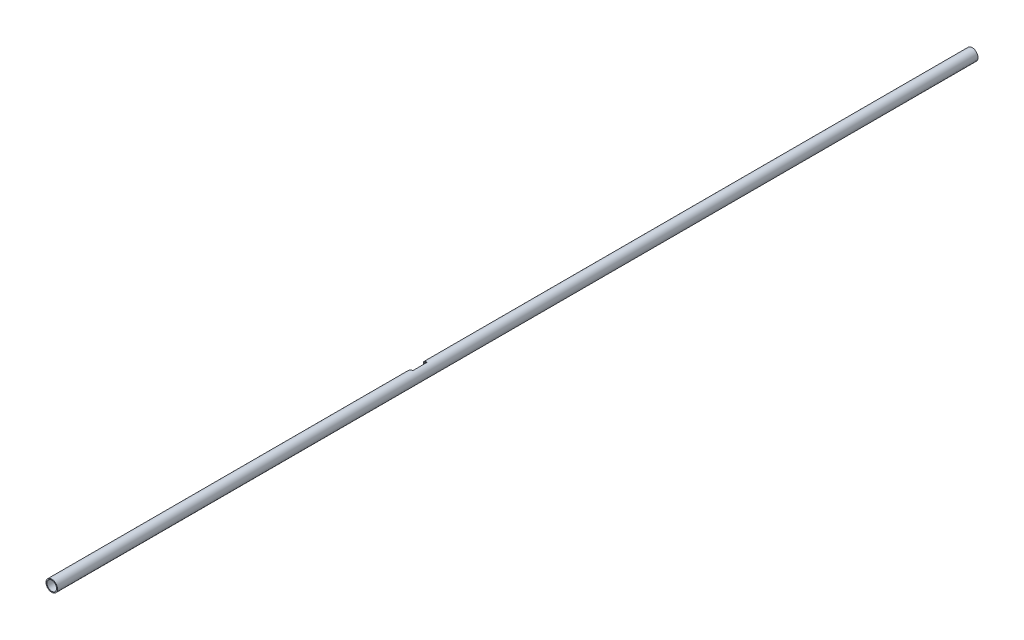
ISO-10303-21;
HEADER;
FILE_DESCRIPTION(('STEP AP214'),'2;1');
FILE_NAME('part.step','',(''),(''),'','','');
FILE_SCHEMA(('AUTOMOTIVE_DESIGN { 1 0 10303 214 1 1 1 1 }'));
ENDSEC;
DATA;
#1=APPLICATION_CONTEXT('core data for automotive mechanical design processes');
#2=APPLICATION_PROTOCOL_DEFINITION('international standard','automotive_design',2000,#1);
#3=PRODUCT_CONTEXT('',#1,'mechanical');
#4=PRODUCT('Part','Part','',(#3));
#5=PRODUCT_RELATED_PRODUCT_CATEGORY('part','',(#4));
#6=PRODUCT_DEFINITION_FORMATION('','',#4);
#7=PRODUCT_DEFINITION_CONTEXT('part definition',#1,'design');
#8=PRODUCT_DEFINITION('design','',#6,#7);
#9=PRODUCT_DEFINITION_SHAPE('','',#8);
#10=(LENGTH_UNIT() NAMED_UNIT(*) SI_UNIT(.MILLI.,.METRE.));
#11=(NAMED_UNIT(*) PLANE_ANGLE_UNIT() SI_UNIT($,.RADIAN.));
#12=(NAMED_UNIT(*) SI_UNIT($,.STERADIAN.) SOLID_ANGLE_UNIT());
#13=UNCERTAINTY_MEASURE_WITH_UNIT(LENGTH_MEASURE(1.E-05),#10,'distance_accuracy_value','');
#14=(GEOMETRIC_REPRESENTATION_CONTEXT(3) GLOBAL_UNCERTAINTY_ASSIGNED_CONTEXT((#13)) GLOBAL_UNIT_ASSIGNED_CONTEXT((#10,
#11,#12)) REPRESENTATION_CONTEXT('',''));
#15=CARTESIAN_POINT('',(0.,0.,0.));
#16=DIRECTION('',(0.,0.,1.));
#17=DIRECTION('',(1.,0.,0.));
#18=AXIS2_PLACEMENT_3D('',#15,#16,#17);
#19=CARTESIAN_POINT('',(0.,0.,3048.));
#20=DIRECTION('',(0.,0.,1.));
#21=DIRECTION('',(1.,0.,0.));
#22=AXIS2_PLACEMENT_3D('',#19,#20,#21);
#23=PLANE('',#22);
#24=CARTESIAN_POINT('',(0.,0.,3048.));
#25=DIRECTION('',(0.,0.,1.));
#26=DIRECTION('',(1.,0.,0.));
#27=AXIS2_PLACEMENT_3D('',#24,#25,#26);
#28=CIRCLE('',#27,19.05);
#29=CARTESIAN_POINT('',(19.05,0.,3048.));
#30=VERTEX_POINT('',#29);
#31=EDGE_CURVE('E142',#30,#30,#28,.T.);
#32=ORIENTED_EDGE('',*,*,#31,.T.);
#33=EDGE_LOOP('',(#32));
#34=FACE_BOUND('',#33,.T.);
#35=CARTESIAN_POINT('',(0.,0.,3048.));
#36=DIRECTION('',(0.,0.,1.));
#37=DIRECTION('',(1.,0.,0.));
#38=AXIS2_PLACEMENT_3D('',#35,#36,#37);
#39=CIRCLE('',#38,15.875);
#40=CARTESIAN_POINT('',(15.875,0.,3048.));
#41=VERTEX_POINT('',#40);
#42=EDGE_CURVE('E136',#41,#41,#39,.T.);
#43=ORIENTED_EDGE('',*,*,#42,.F.);
#44=EDGE_LOOP('',(#43));
#45=FACE_BOUND('',#44,.T.);
#46=ADVANCED_FACE('F32',(#34,#45),#23,.T.);
#47=CARTESIAN_POINT('',(0.,0.,0.));
#48=DIRECTION('',(0.,0.,1.));
#49=DIRECTION('',(1.,0.,0.));
#50=AXIS2_PLACEMENT_3D('',#47,#48,#49);
#51=PLANE('',#50);
#52=CARTESIAN_POINT('',(0.,0.,0.));
#53=DIRECTION('',(0.,0.,1.));
#54=DIRECTION('',(1.,0.,0.));
#55=AXIS2_PLACEMENT_3D('',#52,#53,#54);
#56=CIRCLE('',#55,19.05);
#57=CARTESIAN_POINT('',(19.05,0.,0.));
#58=VERTEX_POINT('',#57);
#59=EDGE_CURVE('E139',#58,#58,#56,.T.);
#60=ORIENTED_EDGE('',*,*,#59,.F.);
#61=EDGE_LOOP('',(#60));
#62=FACE_BOUND('',#61,.T.);
#63=CARTESIAN_POINT('',(0.,0.,0.));
#64=DIRECTION('',(0.,0.,1.));
#65=DIRECTION('',(1.,0.,0.));
#66=AXIS2_PLACEMENT_3D('',#63,#64,#65);
#67=CIRCLE('',#66,15.875);
#68=CARTESIAN_POINT('',(15.875,0.,0.));
#69=VERTEX_POINT('',#68);
#70=EDGE_CURVE('E81',#69,#69,#67,.T.);
#71=ORIENTED_EDGE('',*,*,#70,.T.);
#72=EDGE_LOOP('',(#71));
#73=FACE_BOUND('',#72,.T.);
#74=ADVANCED_FACE('F149',(#62,#73),#51,.F.);
#75=CARTESIAN_POINT('',(0.,0.,3048.));
#76=DIRECTION('',(0.,0.,-1.));
#77=DIRECTION('',(-1.,0.,0.));
#78=AXIS2_PLACEMENT_3D('',#75,#76,#77);
#79=CYLINDRICAL_SURFACE('',#78,19.05);
#80=CARTESIAN_POINT('',(0.,19.05,1852.2671808277));
#81=CARTESIAN_POINT('',(-0.237913261552486,19.0500075669226,1852.26716589824));
#82=CARTESIAN_POINT('',(-0.475820359440934,19.0455432689942,1852.27079845793));
#83=CARTESIAN_POINT('',(-0.951064162118166,19.0277282029307,1852.2852480478));
#84=CARTESIAN_POINT('',(-1.18840091207045,19.014378163365,1852.29606448895));
#85=CARTESIAN_POINT('',(-1.66172427825179,18.9788684265299,1852.32475555512));
#86=CARTESIAN_POINT('',(-1.89771209381287,18.9567184505884,1852.3426223914));
#87=CARTESIAN_POINT('',(-2.36807231072878,18.9037237472348,1852.38519551471));
#88=CARTESIAN_POINT('',(-2.60244469016893,18.8728789021068,1852.40990189435));
#89=CARTESIAN_POINT('',(-3.29829215747621,18.7681203736737,1852.49339141651));
#90=CARTESIAN_POINT('',(-3.75681202461572,18.6816544503487,1852.56181551437));
#91=CARTESIAN_POINT('',(-4.66244518831297,18.4764685925903,1852.721705705));
#92=CARTESIAN_POINT('',(-5.10955575066431,18.3577410046947,1852.81317726496));
#93=CARTESIAN_POINT('',(-5.98795765621618,18.0902383667251,1853.01533198587));
#94=CARTESIAN_POINT('',(-6.41930948505075,17.9415966150532,1853.12592962318));
#95=CARTESIAN_POINT('',(-7.26639917201875,17.615559887581,1853.36305610455));
#96=CARTESIAN_POINT('',(-7.6821376293133,17.438166016531,1853.48958433646));
#97=CARTESIAN_POINT('',(-8.49768945260892,17.0556478749041,1853.75536613615));
#98=CARTESIAN_POINT('',(-8.89746295560427,16.8504592022841,1853.8946490068));
#99=CARTESIAN_POINT('',(-9.67909367745971,16.4139593807486,1854.18230375715));
#100=CARTESIAN_POINT('',(-10.060948704398,16.1826450476773,1854.33067674373));
#101=CARTESIAN_POINT('',(-10.8564159962534,15.6619384534184,1854.6538375673));
#102=CARTESIAN_POINT('',(-11.2673139394046,15.3689240395668,1854.82947920576));
#103=CARTESIAN_POINT('',(-12.0637546860205,14.75201945163,1855.18400252564));
#104=CARTESIAN_POINT('',(-12.4492959211275,14.428127370735,1855.3628844066));
#105=CARTESIAN_POINT('',(-13.1938891566226,13.7505358175611,1855.71989081054));
#106=CARTESIAN_POINT('',(-13.552932285477,13.3968264466337,1855.89801506122));
#107=CARTESIAN_POINT('',(-14.2429269408907,12.6608060219891,1856.24961636432));
#108=CARTESIAN_POINT('',(-14.5738768292642,12.2784933027828,1856.42309314533));
#109=CARTESIAN_POINT('',(-15.2451465976967,11.4373194464688,1856.78272814046));
#110=CARTESIAN_POINT('',(-15.5815436809978,10.974843739489,1856.9677931465));
#111=CARTESIAN_POINT('',(-16.2137879973683,10.0172234159492,1857.32239489818));
#112=CARTESIAN_POINT('',(-16.5096310129868,9.52207540952876,1857.49193002817));
#113=CARTESIAN_POINT('',(-17.0572867999425,8.50213133744733,1857.81051598198));
#114=CARTESIAN_POINT('',(-17.3091299143676,7.97735603635815,1857.9595809071));
#115=CARTESIAN_POINT('',(-17.7655359307114,6.90141460910731,1858.2327947757));
#116=CARTESIAN_POINT('',(-17.9701076176427,6.35025340957205,1858.3569483482));
#117=CARTESIAN_POINT('',(-18.3101545422171,5.28401739618659,1858.56498270943));
#118=CARTESIAN_POINT('',(-18.4505756134686,4.77107065705129,1858.65169401363));
#119=CARTESIAN_POINT('',(-18.6885349327689,3.73166230635024,1858.799353063));
#120=CARTESIAN_POINT('',(-18.7860758531181,3.20520153914652,1858.86030241365));
#121=CARTESIAN_POINT('',(-18.9365485673955,2.14396727874143,1858.95456864965));
#122=CARTESIAN_POINT('',(-18.9895202776267,1.6092016615669,1858.98791026014));
#123=CARTESIAN_POINT('',(-19.0500331020588,0.536113862418739,1859.0260113584));
#124=CARTESIAN_POINT('',(-19.0575795821051,-0.00220789196607137,1859.03077422202));
#125=CARTESIAN_POINT('',(-19.0292136788875,-1.00354059727567,1859.0129029026));
#126=CARTESIAN_POINT('',(-18.9990963706189,-1.46679518249212,1858.99392191017));
#127=CARTESIAN_POINT('',(-18.9053442990758,-2.38850993247263,1858.93501746791));
#128=CARTESIAN_POINT('',(-18.8417133700412,-2.84697063957854,1858.89509641381));
#129=CARTESIAN_POINT('',(-18.6817684312544,-3.75593126314168,1858.79521886666));
#130=CARTESIAN_POINT('',(-18.5854530110353,-4.20643083516116,1858.73526150898));
#131=CARTESIAN_POINT('',(-18.361320835631,-5.09657418070307,1858.59662613637));
#132=CARTESIAN_POINT('',(-18.2335027480993,-5.53621749421487,1858.51794732966));
#133=CARTESIAN_POINT('',(-17.9475472680348,-6.40286205310939,1858.34336116287));
#134=CARTESIAN_POINT('',(-17.7893574589542,-6.82983994748656,1858.24742403611));
#135=CARTESIAN_POINT('',(-17.4443800430196,-7.66821997933194,1858.04031371512));
#136=CARTESIAN_POINT('',(-17.2575928036684,-8.07962231687542,1857.92914071669));
#137=CARTESIAN_POINT('',(-16.8570265577348,-8.88512777933834,1857.69362686788));
#138=CARTESIAN_POINT('',(-16.6432471955372,-9.27923067624941,1857.56928584402));
#139=CARTESIAN_POINT('',(-16.1902483308365,-10.0487690011342,1857.30961718739));
#140=CARTESIAN_POINT('',(-15.9510260158205,-10.4242023585953,1857.17428834039));
#141=CARTESIAN_POINT('',(-15.4171388478185,-11.2010448659687,1856.87742005095));
#142=CARTESIAN_POINT('',(-15.1192825145513,-11.5998196349006,1856.71472050958));
#143=CARTESIAN_POINT('',(-14.4950846033296,-12.3709805231003,1856.38163111637));
#144=CARTESIAN_POINT('',(-14.1687410187786,-12.7433647801098,1856.21124072321));
#145=CARTESIAN_POINT('',(-13.4885883068924,-13.4612557153978,1855.86593035904));
#146=CARTESIAN_POINT('',(-13.1347321854433,-13.8067142936616,1855.69100299372));
#147=CARTESIAN_POINT('',(-12.401421579444,-14.4689793476887,1855.34053687841));
#148=CARTESIAN_POINT('',(-12.0219656723807,-14.7857842289477,1855.16499809497));
#149=CARTESIAN_POINT('',(-11.1857883621707,-15.4303472136638,1854.79368693179));
#150=CARTESIAN_POINT('',(-10.725547194885,-15.7538236022507,1854.5983773441));
#151=CARTESIAN_POINT('',(-9.77512493835074,-16.3605414403376,1854.21794683031));
#152=CARTESIAN_POINT('',(-9.28493893539641,-16.6437762610244,1854.03282758588));
#153=CARTESIAN_POINT('',(-8.27823061346436,-17.1666523017985,1853.68003728454));
#154=CARTESIAN_POINT('',(-7.76180901246432,-17.4064461679541,1853.51230605383));
#155=CARTESIAN_POINT('',(-6.70338967441411,-17.8407952434688,1853.20058712969));
#156=CARTESIAN_POINT('',(-6.16139968402448,-18.035364050473,1853.05659230333));
#157=CARTESIAN_POINT('',(-5.1639713786844,-18.3426351560322,1852.82474192916));
#158=CARTESIAN_POINT('',(-4.71243156933752,-18.4639105575953,1852.7314149047));
#159=CARTESIAN_POINT('',(-3.79763406932198,-18.6735204660137,1852.56822367759));
#160=CARTESIAN_POINT('',(-3.33438106935586,-18.7618679429894,1852.49835023779));
#161=CARTESIAN_POINT('',(-2.63119041126603,-18.8689253625022,1852.4130634991));
#162=CARTESIAN_POINT('',(-2.39429949153897,-18.900452532875,1852.38781813152));
#163=CARTESIAN_POINT('',(-1.91884922194373,-18.9546230604504,1852.34431056888));
#164=CARTESIAN_POINT('',(-1.68028989962893,-18.9772665640143,1852.32604825877));
#165=CARTESIAN_POINT('',(-1.20173979669572,-19.0135731857589,1852.29671643215));
#166=CARTESIAN_POINT('',(-0.96174756682334,-19.0272246853348,1852.28565622171));
#167=CARTESIAN_POINT('',(-0.481172431453062,-19.0454424381129,1852.27088030018));
#168=CARTESIAN_POINT('',(-0.240589475851749,-19.0500078919985,1852.26716523527));
#169=CARTESIAN_POINT('',(0.,-19.05,1852.2671808277));
#170=B_SPLINE_CURVE_WITH_KNOTS('',3,(#80,#81,#82,#83,#84,#85,#86,#87,#88,#89,#90,#91,#92,#93,
#94,#95,#96,#97,#98,#99,#100,#101,#102,#103,#104,#105,#106,#107,#108,#109,#110,#111,#112,#113,
#114,#115,#116,#117,#118,#119,#120,#121,#122,#123,#124,#125,#126,#127,#128,#129,#130,#131,#132,
#133,#134,#135,#136,#137,#138,#139,#140,#141,#142,#143,#144,#145,#146,#147,#148,#149,#150,#151,
#152,#153,#154,#155,#156,#157,#158,#159,#160,#161,#162,#163,#164,#165,#166,#167,#168,#169),
.UNSPECIFIED.,.F.,.F.,(4,2,2,2,2,2,2,2,2,2,2,2,2,2,2,2,2,2,2,2,2,2,2,2,2,2,2,2,2,2,2,2,2,2,2,2,
2,2,2,2,2,2,2,2,4),(0.,0.713659538284325,1.42726056863278,2.14007546311611,2.85290000854321,
4.2655934325813,5.67862228410906,7.08548876133536,8.49230119496029,9.90243089753133,
11.3127326504009,12.9142575198248,14.5158813534507,16.118038998867,17.7202900059383,
19.5211317505805,21.3221606332672,23.1219425504799,24.9213897232974,26.5355472079785,
28.1496040837428,29.7622138624865,31.3746331483099,32.7668190077326,34.1588456239806,
35.5509323194048,36.943077900644,38.3376480491618,39.7322002776946,41.1267708810513,
42.5214958034614,44.090873437741,45.6603617058085,47.2325923357602,48.8049104025291,
50.5892093576005,52.3738018923156,54.1519965250575,55.9296558212526,57.358308144593,
58.7863971337687,59.5071013173353,60.2277936265736,60.9494153280388,61.671100509134),.UNSPECIFIED.);
#171=CARTESIAN_POINT('',(0.,19.05,1852.2671808277));
#172=VERTEX_POINT('',#171);
#173=CARTESIAN_POINT('',(0.,-19.05,1852.2671808277));
#174=VERTEX_POINT('',#173);
#175=EDGE_CURVE('E82',#172,#174,#170,.T.);
#176=ORIENTED_EDGE('',*,*,#175,.T.);
#177=DIRECTION('',(0.,0.,-1.));
#178=VECTOR('',#177,1.);
#179=CARTESIAN_POINT('',(0.,-19.05,3048.));
#180=LINE('',#179,#178);
#181=CARTESIAN_POINT('',(0.,-19.05,1805.3328191723));
#182=VERTEX_POINT('',#181);
#183=EDGE_CURVE('E77',#174,#182,#180,.T.);
#184=ORIENTED_EDGE('',*,*,#183,.T.);
#185=CARTESIAN_POINT('',(0.,-19.05,1805.3328191723));
#186=CARTESIAN_POINT('',(-0.237914153691984,-19.0500075670417,1805.33283410199));
#187=CARTESIAN_POINT('',(-0.475822143650489,-19.0455432355743,1805.32920151495));
#188=CARTESIAN_POINT('',(-0.95106772435545,-19.0277280359797,1805.31475181686));
#189=CARTESIAN_POINT('',(-1.1884053602656,-19.0143778964222,1805.30393529485));
#190=CARTESIAN_POINT('',(-1.66173048176436,-18.978867894416,1805.27524401544));
#191=CARTESIAN_POINT('',(-1.89771916671416,-18.9567177534948,1805.25737704694));
#192=CARTESIAN_POINT('',(-2.36808110452714,-18.9037226566038,1805.21480361077));
#193=CARTESIAN_POINT('',(-2.60245433547799,-18.8728775829311,1805.1900970505));
#194=CARTESIAN_POINT('',(-3.29830083882364,-18.7681188036051,1805.10660733991));
#195=CARTESIAN_POINT('',(-3.75681891684868,-18.6816530205333,1805.0381833634));
#196=CARTESIAN_POINT('',(-4.66244857237881,-18.4764676940087,1804.87829360278));
#197=CARTESIAN_POINT('',(-5.10955741586316,-18.3577404976212,1804.78682235186));
#198=CARTESIAN_POINT('',(-5.98795842654919,-18.0902381320981,1804.58466783679));
#199=CARTESIAN_POINT('',(-6.41931100257116,-17.9415960921057,1804.47406998768));
#200=CARTESIAN_POINT('',(-7.26640215150174,-17.6155586796621,1804.23694302572));
#201=CARTESIAN_POINT('',(-7.68214132262911,-17.4381644102235,1804.11041452406));
#202=CARTESIAN_POINT('',(-8.49769303876842,-17.0556460666155,1803.84463263084));
#203=CARTESIAN_POINT('',(-8.8974657816884,-16.8504576888484,1803.70534998122));
#204=CARTESIAN_POINT('',(-9.67909504442834,-16.4139585525683,1803.41769571169));
#205=CARTESIAN_POINT('',(-10.0609493724786,-16.1826446101205,1803.26932298498));
#206=CARTESIAN_POINT('',(-10.8564054855232,-15.6619453339278,1802.94616670258));
#207=CARTESIAN_POINT('',(-11.2672935150549,-15.3689386049129,1802.77052952407));
#208=CARTESIAN_POINT('',(-12.063716151625,-14.7520505544343,1802.41601498909));
#209=CARTESIAN_POINT('',(-12.4492491630937,-14.4281672930723,1802.23713742962));
#210=CARTESIAN_POINT('',(-13.1938460385474,-13.7505776842584,1801.88013044577));
#211=CARTESIAN_POINT('',(-13.5528996907022,-13.3968599426342,1801.70200133475));
#212=CARTESIAN_POINT('',(-14.2429123643773,-12.6608228438368,1801.3503912768));
#213=CARTESIAN_POINT('',(-14.5738698758174,-12.2785019514082,1801.17691058005));
#214=CARTESIAN_POINT('',(-15.2452066237803,-11.4372443001128,1800.81723970031));
#215=CARTESIAN_POINT('',(-15.5816573531608,-10.9746877470026,1800.63214431774));
#216=CARTESIAN_POINT('',(-16.2140015900617,-10.016883712999,1800.27748408674));
#217=CARTESIAN_POINT('',(-16.5098900402814,-9.52163216708129,1800.10792117577));
#218=CARTESIAN_POINT('',(-17.0575283268076,-8.50164235748947,1799.78934162943));
#219=CARTESIAN_POINT('',(-17.3093227932902,-7.97693462712917,1799.64030425195));
#220=CARTESIAN_POINT('',(-17.7656282909535,-6.90116359008016,1799.36714931439));
#221=CARTESIAN_POINT('',(-17.9701521709603,-6.3501074945223,1799.24302498379));
#222=CARTESIAN_POINT('',(-18.2967017300188,-5.32620454622214,1799.0432469858));
#223=CARTESIAN_POINT('',(-18.4269301606666,-4.85687437293046,1798.96289908963));
#224=CARTESIAN_POINT('',(-18.6515222856821,-3.90659321756069,1798.82367482707));
#225=CARTESIAN_POINT('',(-18.7458905947937,-3.42564373921809,1798.76479569795));
#226=CARTESIAN_POINT('',(-18.8973893204789,-2.45597826270617,1798.67000815948));
#227=CARTESIAN_POINT('',(-18.9545431323425,-1.9672673422146,1798.63408531866));
#228=CARTESIAN_POINT('',(-19.0308483949891,-0.985702436673155,1798.58608134698));
#229=CARTESIAN_POINT('',(-19.0499995417971,-0.492848418515196,1798.57400040681));
#230=CARTESIAN_POINT('',(-19.0500004498985,0.483916056463942,1798.57399960056));
#231=CARTESIAN_POINT('',(-19.0315380930153,0.967826714421099,1798.58564580861));
#232=CARTESIAN_POINT('',(-18.9579680200735,1.93172933497667,1798.63193225655));
#233=CARTESIAN_POINT('',(-18.9028608707327,2.41172135806121,1798.66657214085));
#234=CARTESIAN_POINT('',(-18.7567811892408,3.36420800661081,1798.75799313547));
#235=CARTESIAN_POINT('',(-18.6657974678684,3.83670024516548,1798.81478115333));
#236=CARTESIAN_POINT('',(-18.4492081253785,4.77064312049217,1798.94912652618));
#237=CARTESIAN_POINT('',(-18.3236019404525,5.23209357732163,1799.0266842194));
#238=CARTESIAN_POINT('',(-18.0399652699786,6.13896547312149,1799.20039835224));
#239=CARTESIAN_POINT('',(-17.8820808393242,6.58444884700174,1799.29647090598));
#240=CARTESIAN_POINT('',(-17.5352833397821,7.45906619035572,1799.50536594758));
#241=CARTESIAN_POINT('',(-17.3463704656401,7.88820026242271,1799.61818833032));
#242=CARTESIAN_POINT('',(-16.939320017612,8.72809980980323,1799.85829770114));
#243=CARTESIAN_POINT('',(-16.7211839946016,9.13886625834661,1799.98558392156));
#244=CARTESIAN_POINT('',(-16.2574144369317,9.94049551036888,1800.25221372785));
#245=CARTESIAN_POINT('',(-16.0117778739574,10.3313561149401,1800.39155864123));
#246=CARTESIAN_POINT('',(-15.4739177901683,11.1223691722249,1800.69133743608));
#247=CARTESIAN_POINT('',(-15.1795381102433,11.5207540673358,1800.85256641061));
#248=CARTESIAN_POINT('',(-14.5624763475896,12.2914817788361,1801.18286099129));
#249=CARTESIAN_POINT('',(-14.2397930853102,12.663823508714,1801.35192692389));
#250=CARTESIAN_POINT('',(-13.5671836246638,13.3819448018547,1801.69477567355));
#251=CARTESIAN_POINT('',(-13.2172142598011,13.727680484639,1801.86856566912));
#252=CARTESIAN_POINT('',(-12.4918477463068,14.3908922168729,1802.21704212433));
#253=CARTESIAN_POINT('',(-12.1164489336129,14.7083664137842,1802.39172864194));
#254=CARTESIAN_POINT('',(-11.2873636395029,15.3561684071717,1802.7623906972));
#255=CARTESIAN_POINT('',(-10.8300569007558,15.6821240080865,1802.95794126779));
#256=CARTESIAN_POINT('',(-9.88547176007127,16.2940682653242,1803.33935479063));
#257=CARTESIAN_POINT('',(-9.39818864184241,16.5800506092315,1803.5252162099));
#258=CARTESIAN_POINT('',(-8.39715816889244,17.1087551853641,1803.88007620821));
#259=CARTESIAN_POINT('',(-7.88350908314443,17.3516248756513,1804.049131361));
#260=CARTESIAN_POINT('',(-6.83047578714224,17.7924877091458,1804.36412596754));
#261=CARTESIAN_POINT('',(-6.29109841589317,17.990492698549,1804.51007152014));
#262=CARTESIAN_POINT('',(-5.28671126493464,18.307917238977,1804.74873281407));
#263=CARTESIAN_POINT('',(-4.8252753749099,18.4350309119997,1804.84629544277));
#264=CARTESIAN_POINT('',(-3.88987463160733,18.6548081357988,1805.01705047138));
#265=CARTESIAN_POINT('',(-3.41591492446545,18.747485607959,1805.09025271811));
#266=CARTESIAN_POINT('',(-2.69607464054149,18.8598388532735,1805.17967403736));
#267=CARTESIAN_POINT('',(-2.45346219807751,18.8929394219366,1805.20616113088));
#268=CARTESIAN_POINT('',(-1.96644459477794,18.9498197790469,1805.25182066811));
#269=CARTESIAN_POINT('',(-1.72203946560219,18.9735997316994,1805.27099324068));
#270=CARTESIAN_POINT('',(-1.2316829556265,19.0117332790076,1805.30179357217));
#271=CARTESIAN_POINT('',(-0.985729907213888,19.0260738283793,1805.31341088943));
#272=CARTESIAN_POINT('',(-0.493187017172825,19.0452120016008,1805.32893266052));
#273=CARTESIAN_POINT('',(-0.246597116526002,19.0500087067213,1805.33283637181));
#274=CARTESIAN_POINT('',(0.,19.05,1805.3328191723));
#275=B_SPLINE_CURVE_WITH_KNOTS('',3,(#185,#186,#187,#188,#189,#190,#191,#192,#193,#194,#195,
#196,#197,#198,#199,#200,#201,#202,#203,#204,#205,#206,#207,#208,#209,#210,#211,#212,#213,#214,
#215,#216,#217,#218,#219,#220,#221,#222,#223,#224,#225,#226,#227,#228,#229,#230,#231,#232,#233,
#234,#235,#236,#237,#238,#239,#240,#241,#242,#243,#244,#245,#246,#247,#248,#249,#250,#251,#252,
#253,#254,#255,#256,#257,#258,#259,#260,#261,#262,#263,#264,#265,#266,#267,#268,#269,#270,#271,
#272,#273,#274),.UNSPECIFIED.,.F.,.F.,(4,2,2,2,2,2,2,2,2,2,2,2,2,2,2,2,2,2,2,2,2,2,2,2,2,2,2,2,
2,2,2,2,2,2,2,2,2,2,2,2,2,2,2,2,4),(0.,0.713662213809833,1.42726591986887,2.14008347680692,
2.85291068358596,4.26559878477825,5.67862229166949,7.08549124293628,8.49230623570843,
9.90243342727396,11.31273265751,12.9142177386418,14.5158035036296,16.1180037287415,
17.720290012684,19.5214360962541,21.3228065426876,23.1223430407749,24.9213898221624,
26.4005380563321,27.8794958783256,29.357523037752,30.835562019552,32.2868130908804,
33.7380417188957,35.189723315993,36.6414285543511,38.0867048927598,39.5319721604426,
40.9771627579978,42.4225126544179,43.9837453088149,45.5450430584658,47.1088629466264,
48.6727852676945,50.4546090713785,52.2367139363628,54.0126008288795,55.7880182636023,
57.2516578414784,58.7147050742561,59.4533296554043,60.1919412232981,60.9315714233388,
61.6712728197458),.UNSPECIFIED.);
#276=CARTESIAN_POINT('',(0.,19.05,1805.3328191723));
#277=VERTEX_POINT('',#276);
#278=EDGE_CURVE('E73',#182,#277,#275,.T.);
#279=ORIENTED_EDGE('',*,*,#278,.T.);
#280=DIRECTION('',(0.,0.,-1.));
#281=VECTOR('',#280,1.);
#282=CARTESIAN_POINT('',(0.,19.05,3048.));
#283=LINE('',#282,#281);
#284=EDGE_CURVE('E75',#277,#172,#283,.F.);
#285=ORIENTED_EDGE('',*,*,#284,.T.);
#286=EDGE_LOOP('',(#176,#184,#279,#285));
#287=FACE_BOUND('',#286,.T.);
#288=ORIENTED_EDGE('',*,*,#31,.F.);
#289=EDGE_LOOP('',(#288));
#290=FACE_BOUND('',#289,.T.);
#291=ORIENTED_EDGE('',*,*,#59,.T.);
#292=EDGE_LOOP('',(#291));
#293=FACE_BOUND('',#292,.T.);
#294=ADVANCED_FACE('F34',(#287,#290,#293),#79,.T.);
#295=CARTESIAN_POINT('',(0.,0.,3048.));
#296=DIRECTION('',(0.,0.,-1.));
#297=DIRECTION('',(-1.,0.,0.));
#298=AXIS2_PLACEMENT_3D('',#295,#296,#297);
#299=CYLINDRICAL_SURFACE('',#298,15.875);
#300=DIRECTION('',(0.,0.,-1.));
#301=VECTOR('',#300,1.);
#302=CARTESIAN_POINT('',(0.,-15.875,3048.));
#303=LINE('',#302,#301);
#304=CARTESIAN_POINT('',(0.,-15.875,1854.52149783741));
#305=VERTEX_POINT('',#304);
#306=CARTESIAN_POINT('',(0.,-15.875,1803.07850216259));
#307=VERTEX_POINT('',#306);
#308=EDGE_CURVE('E11',#305,#307,#303,.T.);
#309=ORIENTED_EDGE('',*,*,#308,.F.);
#310=CARTESIAN_POINT('',(0.,15.875,1854.52149783741));
#311=CARTESIAN_POINT('',(-0.206222700758855,15.8750017340159,1854.52149260312));
#312=CARTESIAN_POINT('',(-0.412415683415285,15.8709807120125,1854.52397899471));
#313=CARTESIAN_POINT('',(-0.824360989498958,15.854921693772,1854.53388163463));
#314=CARTESIAN_POINT('',(-1.03011333356162,15.842884081575,1854.54129764681));
#315=CARTESIAN_POINT('',(-1.64578655641463,15.7948183060289,1854.57084212032));
#316=CARTESIAN_POINT('',(-2.05450732681326,15.7468370881165,1854.60026721487));
#317=CARTESIAN_POINT('',(-2.862682241147,15.6200842156362,1854.67719937251));
#318=CARTESIAN_POINT('',(-3.26217835717111,15.5415070366789,1854.7245921792));
#319=CARTESIAN_POINT('',(-4.05185413538644,15.3545676120131,1854.83574726635));
#320=CARTESIAN_POINT('',(-4.44203255363968,15.2462014132839,1854.89951171928));
#321=CARTESIAN_POINT('',(-5.20964493323977,15.001238520634,1855.04107178655));
#322=CARTESIAN_POINT('',(-5.58710862397977,14.8647138991808,1855.11883151602));
#323=CARTESIAN_POINT('',(-6.32837824806808,14.5645856609847,1855.28609847547));
#324=CARTESIAN_POINT('',(-6.69218440390225,14.4009824855957,1855.37560551399));
#325=CARTESIAN_POINT('',(-7.40506699263126,14.0477433809531,1855.56400735112));
#326=CARTESIAN_POINT('',(-7.75412126941717,13.8580699945775,1855.66291559294));
#327=CARTESIAN_POINT('',(-8.43571188019184,13.4540482429608,1855.86752573089));
#328=CARTESIAN_POINT('',(-8.76824205414976,13.239690773057,1855.97323012737));
#329=CARTESIAN_POINT('',(-9.4448283500408,12.766997728732,1856.19871293394));
#330=CARTESIAN_POINT('',(-9.78719583809342,12.5064369086,1856.3188984396));
#331=CARTESIAN_POINT('',(-10.449275833262,11.958797901156,1856.56126608357));
#332=CARTESIAN_POINT('',(-10.7689870882389,11.6717182502481,1856.68344833177));
#333=CARTESIAN_POINT('',(-11.3844352041962,11.0722563530847,1856.92687146066));
#334=CARTESIAN_POINT('',(-11.6801614153074,10.759862988743,1857.04811190179));
#335=CARTESIAN_POINT('',(-12.2458561773948,10.1113655848614,1857.28667567902));
#336=CARTESIAN_POINT('',(-12.515833243643,9.77526944826024,1857.40400030168));
#337=CARTESIAN_POINT('',(-13.0482152861493,9.05404324493873,1857.64077376684));
#338=CARTESIAN_POINT('',(-13.3084470381916,8.66712971105579,1857.75969396813));
#339=CARTESIAN_POINT('',(-13.7951135403824,7.86948130699937,1857.98654236781));
#340=CARTESIAN_POINT('',(-14.021546091729,7.45874488944325,1858.09446985092));
#341=CARTESIAN_POINT('',(-14.4382135606974,6.61621800966437,1858.29617331168));
#342=CARTESIAN_POINT('',(-14.6284672400788,6.18443860673783,1858.38995661903));
#343=CARTESIAN_POINT('',(-14.970646273413,5.3027272418518,1858.56060635043));
#344=CARTESIAN_POINT('',(-15.1225762006852,4.85279745328687,1858.63747479286));
#345=CARTESIAN_POINT('',(-15.3758818219726,3.97374787447386,1858.76668614954));
#346=CARTESIAN_POINT('',(-15.4802540143398,3.54570160724974,1858.82046393238));
#347=CARTESIAN_POINT('',(-15.6532626627717,2.68058455067384,1858.91004134311));
#348=CARTESIAN_POINT('',(-15.7219008023102,2.24351418746672,1858.94584181792));
#349=CARTESIAN_POINT('',(-15.8224546147549,1.36427480465504,1858.99840532121));
#350=CARTESIAN_POINT('',(-15.8543906690087,0.922108752712672,1859.01517891561));
#351=CARTESIAN_POINT('',(-15.8811389710826,0.0363579750867495,1859.02922235977));
#352=CARTESIAN_POINT('',(-15.8759538082764,-0.407226649487418,1859.02649356993));
#353=CARTESIAN_POINT('',(-15.8308252894014,-1.24941134728986,1859.00281747528));
#354=CARTESIAN_POINT('',(-15.7942611112255,-1.6482479151647,1858.98364146828));
#355=CARTESIAN_POINT('',(-15.6913035913083,-2.44097149272917,1858.92989423175));
#356=CARTESIAN_POINT('',(-15.6249125747707,-2.83485888578043,1858.89532420229));
#357=CARTESIAN_POINT('',(-15.4630518524803,-3.6150223370577,1858.81160831178));
#358=CARTESIAN_POINT('',(-15.367581704178,-4.00129827935131,1858.7624622289));
#359=CARTESIAN_POINT('',(-15.1485678277687,-4.76380969175,1858.65072349346));
#360=CARTESIAN_POINT('',(-15.0250230486454,-5.14004478537136,1858.5881303375));
#361=CARTESIAN_POINT('',(-14.74934299216,-5.88491105179767,1858.45002807136));
#362=CARTESIAN_POINT('',(-14.5968712429359,-6.25338945790983,1858.37436800659));
#363=CARTESIAN_POINT('',(-14.2657089024662,-6.97589500309762,1858.21232826172));
#364=CARTESIAN_POINT('',(-14.0870183805037,-7.32992218035742,1858.12594860995));
#365=CARTESIAN_POINT('',(-13.7047451110493,-8.02196311238843,1857.94424826124));
#366=CARTESIAN_POINT('',(-13.5011567940915,-8.35997326071205,1857.84892556493));
#367=CARTESIAN_POINT('',(-13.0704527985152,-9.01852102573465,1857.65126649299));
#368=CARTESIAN_POINT('',(-12.8433346539485,-9.3390568057199,1857.54892938262));
#369=CARTESIAN_POINT('',(-12.3427138059729,-9.99296426854645,1857.32862615853));
#370=CARTESIAN_POINT('',(-12.0668429535017,-10.3243456684445,1857.21012710794));
#371=CARTESIAN_POINT('',(-11.4897425369752,-10.9629693344758,1856.9698563135));
#372=CARTESIAN_POINT('',(-11.1885113612791,-11.2702100640745,1856.84808436198));
#373=CARTESIAN_POINT('',(-10.5618768024827,-11.8594919424332,1856.60405247449));
#374=CARTESIAN_POINT('',(-10.236448764465,-12.1415067250779,1856.48179216431));
#375=CARTESIAN_POINT('',(-9.56315954710207,-12.6786063026331,1856.23994849483));
#376=CARTESIAN_POINT('',(-9.21529880562401,-12.9336916229274,1856.12036508334));
#377=CARTESIAN_POINT('',(-8.47128008203608,-13.4338737860212,1855.87812951381));
#378=CARTESIAN_POINT('',(-8.07346143065705,-13.6767309900732,1855.75593705839));
#379=CARTESIAN_POINT('',(-7.25546130019065,-14.1277044098339,1855.52234231146));
#380=CARTESIAN_POINT('',(-6.8352767056574,-14.3358157688594,1855.41094152927));
#381=CARTESIAN_POINT('',(-5.97599615215171,-14.7147227623793,1855.20330669841));
#382=CARTESIAN_POINT('',(-5.53694659591232,-14.8856043138989,1855.10703787523));
#383=CARTESIAN_POINT('',(-4.64209548875148,-15.188464290303,1854.93335401457));
#384=CARTESIAN_POINT('',(-4.18630115414043,-15.3204592575506,1854.85593096254));
#385=CARTESIAN_POINT('',(-3.42181246421384,-15.5049538685585,1854.74637953447));
#386=CARTESIAN_POINT('',(-3.11680295370183,-15.5691558886041,1854.70784874492));
#387=CARTESIAN_POINT('',(-2.5024880609191,-15.679621183726,1854.6411438589));
#388=CARTESIAN_POINT('',(-2.19318390644665,-15.7258894807916,1854.61296686317));
#389=CARTESIAN_POINT('',(-1.57074670040796,-15.8002160001095,1854.56754280678));
#390=CARTESIAN_POINT('',(-1.25760557929058,-15.8282248344322,1854.55032539238));
#391=CARTESIAN_POINT('',(-0.629650144182748,-15.8656352346947,1854.52727690005));
#392=CARTESIAN_POINT('',(-0.314835107101094,-15.8750279697161,1854.52145122604));
#393=CARTESIAN_POINT('',(0.,-15.875,1854.52149783741));
#394=B_SPLINE_CURVE_WITH_KNOTS('',3,(#310,#311,#312,#313,#314,#315,#316,#317,#318,#319,#320,
#321,#322,#323,#324,#325,#326,#327,#328,#329,#330,#331,#332,#333,#334,#335,#336,#337,#338,#339,
#340,#341,#342,#343,#344,#345,#346,#347,#348,#349,#350,#351,#352,#353,#354,#355,#356,#357,#358,
#359,#360,#361,#362,#363,#364,#365,#366,#367,#368,#369,#370,#371,#372,#373,#374,#375,#376,#377,
#378,#379,#380,#381,#382,#383,#384,#385,#386,#387,#388,#389,#390,#391,#392,#393),.UNSPECIFIED.,
.F.,.F.,(4,2,2,2,2,2,2,2,2,2,2,2,2,2,2,2,2,2,2,2,2,2,2,2,2,2,2,2,2,2,2,2,2,2,2,2,2,2,2,2,2,4),
(0.,0.618555298918818,1.23708096767188,2.47298553777627,3.701159360887,4.92949624213598,
6.15472732303557,7.37993843583824,8.60692867448584,9.83437294387823,11.1731081950937,
12.511917376402,13.8513177995606,15.1902737343477,16.632042321425,18.0739046617006,
19.5150172248418,20.9559577330814,22.2857007226619,23.6153810607971,24.9443226454734,
26.2731715313287,27.4746514473859,28.6760377162026,29.8774422695892,31.0788918067816,
32.2952838478843,33.5116726747332,34.728334098838,35.9451231594429,37.2852037983221,
38.6253696632945,39.9669202876605,41.3084447340314,42.7521213689693,44.1959996286143,
45.6365096314625,47.0764059531857,48.0179650381559,48.959260267056,49.9030910490171,
50.8473694489054),.UNSPECIFIED.);
#395=CARTESIAN_POINT('',(0.,15.875,1854.52149783741));
#396=VERTEX_POINT('',#395);
#397=EDGE_CURVE('E97',#396,#305,#394,.T.);
#398=ORIENTED_EDGE('',*,*,#397,.F.);
#399=DIRECTION('',(0.,0.,-1.));
#400=VECTOR('',#399,1.);
#401=CARTESIAN_POINT('',(0.,15.875,3048.));
#402=LINE('',#401,#400);
#403=CARTESIAN_POINT('',(0.,15.875,1803.07850216259));
#404=VERTEX_POINT('',#403);
#405=EDGE_CURVE('E104',#404,#396,#402,.F.);
#406=ORIENTED_EDGE('',*,*,#405,.F.);
#407=CARTESIAN_POINT('',(0.,-15.875,1803.07850216259));
#408=CARTESIAN_POINT('',(-0.206222700758855,-15.8750017340159,1803.07850739688));
#409=CARTESIAN_POINT('',(-0.412415683415285,-15.8709807120125,1803.07602100529));
#410=CARTESIAN_POINT('',(-0.824360989498958,-15.854921693772,1803.06611836537));
#411=CARTESIAN_POINT('',(-1.03011333356162,-15.842884081575,1803.05870235319));
#412=CARTESIAN_POINT('',(-1.64578655641463,-15.7948183060289,1803.02915787968));
#413=CARTESIAN_POINT('',(-2.05450732681326,-15.7468370881165,1802.99973278513));
#414=CARTESIAN_POINT('',(-2.862682241147,-15.6200842156362,1802.92280062749));
#415=CARTESIAN_POINT('',(-3.26217835717111,-15.5415070366789,1802.8754078208));
#416=CARTESIAN_POINT('',(-4.05185413538644,-15.3545676120131,1802.76425273364));
#417=CARTESIAN_POINT('',(-4.44203255363968,-15.2462014132839,1802.70048828072));
#418=CARTESIAN_POINT('',(-5.20964493323977,-15.001238520634,1802.55892821345));
#419=CARTESIAN_POINT('',(-5.58710862397977,-14.8647138991808,1802.48116848398));
#420=CARTESIAN_POINT('',(-6.32837824806808,-14.5645856609847,1802.31390152453));
#421=CARTESIAN_POINT('',(-6.69218440390225,-14.4009824855957,1802.22439448601));
#422=CARTESIAN_POINT('',(-7.40506699263126,-14.0477433809531,1802.03599264888));
#423=CARTESIAN_POINT('',(-7.75412126941717,-13.8580699945775,1801.93708440706));
#424=CARTESIAN_POINT('',(-8.43571188019184,-13.4540482429608,1801.73247426911));
#425=CARTESIAN_POINT('',(-8.76824205414976,-13.239690773057,1801.62676987263));
#426=CARTESIAN_POINT('',(-9.4448283500408,-12.766997728732,1801.40128706606));
#427=CARTESIAN_POINT('',(-9.78719583809344,-12.5064369086,1801.2811015604));
#428=CARTESIAN_POINT('',(-10.449275833262,-11.958797901156,1801.03873391643));
#429=CARTESIAN_POINT('',(-10.7689870882389,-11.6717182502481,1800.91655166823));
#430=CARTESIAN_POINT('',(-11.3844352041962,-11.0722563530846,1800.67312853934));
#431=CARTESIAN_POINT('',(-11.6801614153074,-10.759862988743,1800.55188809821));
#432=CARTESIAN_POINT('',(-12.2458561773948,-10.1113655848614,1800.31332432098));
#433=CARTESIAN_POINT('',(-12.515833243643,-9.77526944826023,1800.19599969832));
#434=CARTESIAN_POINT('',(-13.0482152861493,-9.05404324493871,1799.95922623316));
#435=CARTESIAN_POINT('',(-13.3084470381916,-8.66712971105579,1799.84030603187));
#436=CARTESIAN_POINT('',(-13.7951135403823,-7.86948130699937,1799.61345763219));
#437=CARTESIAN_POINT('',(-14.021546091729,-7.45874488944325,1799.50553014908));
#438=CARTESIAN_POINT('',(-14.4382135606974,-6.61621800966439,1799.30382668832));
#439=CARTESIAN_POINT('',(-14.6284672400788,-6.18443860673788,1799.21004338097));
#440=CARTESIAN_POINT('',(-14.970646273413,-5.30272724185185,1799.03939364957));
#441=CARTESIAN_POINT('',(-15.1225762006852,-4.8527974532869,1798.96252520714));
#442=CARTESIAN_POINT('',(-15.3758818219726,-3.97374787447386,1798.83331385046));
#443=CARTESIAN_POINT('',(-15.4802540143398,-3.54570160724974,1798.77953606762));
#444=CARTESIAN_POINT('',(-15.6532626627717,-2.68058455067384,1798.68995865689));
#445=CARTESIAN_POINT('',(-15.7219008023102,-2.24351418746672,1798.65415818208));
#446=CARTESIAN_POINT('',(-15.8224546147549,-1.36427480465503,1798.60159467879));
#447=CARTESIAN_POINT('',(-15.8543906690087,-0.922108752712669,1798.58482108439));
#448=CARTESIAN_POINT('',(-15.8811389710826,-0.0363579750867473,1798.57077764023));
#449=CARTESIAN_POINT('',(-15.8759538082764,0.407226649487419,1798.57350643007));
#450=CARTESIAN_POINT('',(-15.8308252894014,1.24941134728986,1798.59718252472));
#451=CARTESIAN_POINT('',(-15.7942611112255,1.6482479151647,1798.61635853172));
#452=CARTESIAN_POINT('',(-15.6913035913083,2.44097149272917,1798.67010576825));
#453=CARTESIAN_POINT('',(-15.6249125747707,2.83485888578043,1798.70467579771));
#454=CARTESIAN_POINT('',(-15.4630518524803,3.61502233705768,1798.78839168822));
#455=CARTESIAN_POINT('',(-15.367581704178,4.00129827935127,1798.8375377711));
#456=CARTESIAN_POINT('',(-15.1485678277687,4.76380969174996,1798.94927650654));
#457=CARTESIAN_POINT('',(-15.0250230486454,5.14004478537134,1799.0118696625));
#458=CARTESIAN_POINT('',(-14.74934299216,5.88491105179767,1799.14997192864));
#459=CARTESIAN_POINT('',(-14.5968712429359,6.25338945790983,1799.22563199341));
#460=CARTESIAN_POINT('',(-14.2657089024662,6.97589500309762,1799.38767173828));
#461=CARTESIAN_POINT('',(-14.0870183805037,7.32992218035742,1799.47405139005));
#462=CARTESIAN_POINT('',(-13.7047451110493,8.02196311238843,1799.65575173876));
#463=CARTESIAN_POINT('',(-13.5011567940915,8.35997326071205,1799.75107443507));
#464=CARTESIAN_POINT('',(-13.0704527985152,9.01852102573464,1799.94873350701));
#465=CARTESIAN_POINT('',(-12.8433346539485,9.3390568057199,1800.05107061738));
#466=CARTESIAN_POINT('',(-12.3427138059729,9.99296426854648,1800.27137384146));
#467=CARTESIAN_POINT('',(-12.0668429535016,10.3243456684446,1800.38987289206));
#468=CARTESIAN_POINT('',(-11.4897425369751,10.9629693344759,1800.6301436865));
#469=CARTESIAN_POINT('',(-11.1885113612791,11.2702100640746,1800.75191563802));
#470=CARTESIAN_POINT('',(-10.5618768024827,11.8594919424332,1800.99594752551));
#471=CARTESIAN_POINT('',(-10.2364487644649,12.1415067250779,1801.11820783569));
#472=CARTESIAN_POINT('',(-9.56315954710206,12.6786063026331,1801.36005150517));
#473=CARTESIAN_POINT('',(-9.21529880562401,12.9336916229274,1801.47963491666));
#474=CARTESIAN_POINT('',(-8.47128008203608,13.4338737860212,1801.72187048619));
#475=CARTESIAN_POINT('',(-8.07346143065705,13.6767309900732,1801.84406294161));
#476=CARTESIAN_POINT('',(-7.25546130019065,14.1277044098339,1802.07765768854));
#477=CARTESIAN_POINT('',(-6.8352767056574,14.3358157688594,1802.18905847073));
#478=CARTESIAN_POINT('',(-5.97599615215171,14.7147227623793,1802.39669330159));
#479=CARTESIAN_POINT('',(-5.53694659591232,14.8856043138989,1802.49296212477));
#480=CARTESIAN_POINT('',(-4.64209548875148,15.188464290303,1802.66664598543));
#481=CARTESIAN_POINT('',(-4.18630115414043,15.3204592575506,1802.74406903746));
#482=CARTESIAN_POINT('',(-3.42181246421385,15.5049538685585,1802.85362046553));
#483=CARTESIAN_POINT('',(-3.11680295370186,15.5691558886041,1802.89215125508));
#484=CARTESIAN_POINT('',(-2.50248806091915,15.679621183726,1802.9588561411));
#485=CARTESIAN_POINT('',(-2.1931839064467,15.7258894807916,1802.98703313683));
#486=CARTESIAN_POINT('',(-1.570746700408,15.8002160001095,1803.03245719322));
#487=CARTESIAN_POINT('',(-1.25760557929062,15.8282248344322,1803.04967460762));
#488=CARTESIAN_POINT('',(-0.629650144182767,15.8656352346947,1803.07272309995));
#489=CARTESIAN_POINT('',(-0.314835107101103,15.8750279697161,1803.07854877396));
#490=CARTESIAN_POINT('',(0.,15.875,1803.07850216259));
#491=B_SPLINE_CURVE_WITH_KNOTS('',3,(#407,#408,#409,#410,#411,#412,#413,#414,#415,#416,#417,
#418,#419,#420,#421,#422,#423,#424,#425,#426,#427,#428,#429,#430,#431,#432,#433,#434,#435,#436,
#437,#438,#439,#440,#441,#442,#443,#444,#445,#446,#447,#448,#449,#450,#451,#452,#453,#454,#455,
#456,#457,#458,#459,#460,#461,#462,#463,#464,#465,#466,#467,#468,#469,#470,#471,#472,#473,#474,
#475,#476,#477,#478,#479,#480,#481,#482,#483,#484,#485,#486,#487,#488,#489,#490),.UNSPECIFIED.,
.F.,.F.,(4,2,2,2,2,2,2,2,2,2,2,2,2,2,2,2,2,2,2,2,2,2,2,2,2,2,2,2,2,2,2,2,2,2,2,2,2,2,2,2,2,4),
(0.,0.618555298918818,1.23708096767188,2.47298553777627,3.701159360887,4.92949624213598,
6.15472732303557,7.37993843583824,8.60692867448584,9.83437294387823,11.1731081950937,
12.511917376402,13.8513177995607,15.1902737343477,16.632042321425,18.0739046617006,
19.5150172248417,20.9559577330814,22.2857007226619,23.6153810607971,24.9443226454734,
26.2731715313287,27.4746514473859,28.6760377162026,29.8774422695892,31.0788918067816,
32.2952838478843,33.5116726747332,34.728334098838,35.9451231594429,37.2852037983222,
38.6253696632945,39.9669202876605,41.3084447340314,42.7521213689693,44.1959996286143,
45.6365096314625,47.0764059531857,48.0179650381559,48.959260267056,49.9030910490171,
50.8473694489054),.UNSPECIFIED.);
#492=EDGE_CURVE('E41',#307,#404,#491,.T.);
#493=ORIENTED_EDGE('',*,*,#492,.F.);
#494=EDGE_LOOP('',(#309,#398,#406,#493));
#495=FACE_BOUND('',#494,.T.);
#496=ORIENTED_EDGE('',*,*,#42,.T.);
#497=EDGE_LOOP('',(#496));
#498=FACE_BOUND('',#497,.T.);
#499=ORIENTED_EDGE('',*,*,#70,.F.);
#500=EDGE_LOOP('',(#499));
#501=FACE_BOUND('',#500,.T.);
#502=ADVANCED_FACE('F102',(#495,#498,#501),#299,.F.);
#503=CARTESIAN_POINT('',(-19.05,0.,1828.8));
#504=DIRECTION('',(1.,0.,0.));
#505=DIRECTION('',(0.,0.,-1.));
#506=AXIS2_PLACEMENT_3D('',#503,#504,#505);
#507=CYLINDRICAL_SURFACE('',#506,30.2260000000002);
#508=ORIENTED_EDGE('',*,*,#278,.F.);
#509=CARTESIAN_POINT('',(0.,0.,1828.8));
#510=DIRECTION('',(1.,0.,0.));
#511=DIRECTION('',(0.,0.,-1.));
#512=AXIS2_PLACEMENT_3D('',#509,#510,#511);
#513=CIRCLE('',#512,30.2260000000002);
#514=EDGE_CURVE('E90',#182,#307,#513,.T.);
#515=ORIENTED_EDGE('',*,*,#514,.T.);
#516=ORIENTED_EDGE('',*,*,#492,.T.);
#517=EDGE_CURVE('E53',#404,#277,#513,.T.);
#518=ORIENTED_EDGE('',*,*,#517,.T.);
#519=EDGE_LOOP('',(#508,#515,#516,#518));
#520=FACE_BOUND('',#519,.T.);
#521=ADVANCED_FACE('F86',(#520),#507,.F.);
#522=EDGE_CURVE('E48',#172,#396,#513,.T.);
#523=ORIENTED_EDGE('',*,*,#522,.T.);
#524=ORIENTED_EDGE('',*,*,#397,.T.);
#525=EDGE_CURVE('E91',#305,#174,#513,.T.);
#526=ORIENTED_EDGE('',*,*,#525,.T.);
#527=ORIENTED_EDGE('',*,*,#175,.F.);
#528=EDGE_LOOP('',(#523,#524,#526,#527));
#529=FACE_BOUND('',#528,.T.);
#530=ADVANCED_FACE('F95',(#529),#507,.F.);
#531=CARTESIAN_POINT('',(0.,0.,1828.8));
#532=DIRECTION('',(1.,0.,0.));
#533=DIRECTION('',(0.,0.,-1.));
#534=AXIS2_PLACEMENT_3D('',#531,#532,#533);
#535=PLANE('',#534);
#536=ORIENTED_EDGE('',*,*,#525,.F.);
#537=ORIENTED_EDGE('',*,*,#308,.T.);
#538=ORIENTED_EDGE('',*,*,#514,.F.);
#539=ORIENTED_EDGE('',*,*,#183,.F.);
#540=EDGE_LOOP('',(#536,#537,#538,#539));
#541=FACE_BOUND('',#540,.T.);
#542=ADVANCED_FACE('F100',(#541),#535,.F.);
#543=ORIENTED_EDGE('',*,*,#517,.F.);
#544=ORIENTED_EDGE('',*,*,#405,.T.);
#545=ORIENTED_EDGE('',*,*,#522,.F.);
#546=ORIENTED_EDGE('',*,*,#284,.F.);
#547=EDGE_LOOP('',(#543,#544,#545,#546));
#548=FACE_BOUND('',#547,.T.);
#549=ADVANCED_FACE('F84',(#548),#535,.F.);
#550=CLOSED_SHELL('',(#46,#74,#294,#502,#521,#530,#542,#549));
#551=MANIFOLD_SOLID_BREP('B2',#550);
#552=ADVANCED_BREP_SHAPE_REPRESENTATION('',(#18,#551),#14);
#553=SHAPE_DEFINITION_REPRESENTATION(#9,#552);
ENDSEC;
END-ISO-10303-21;
